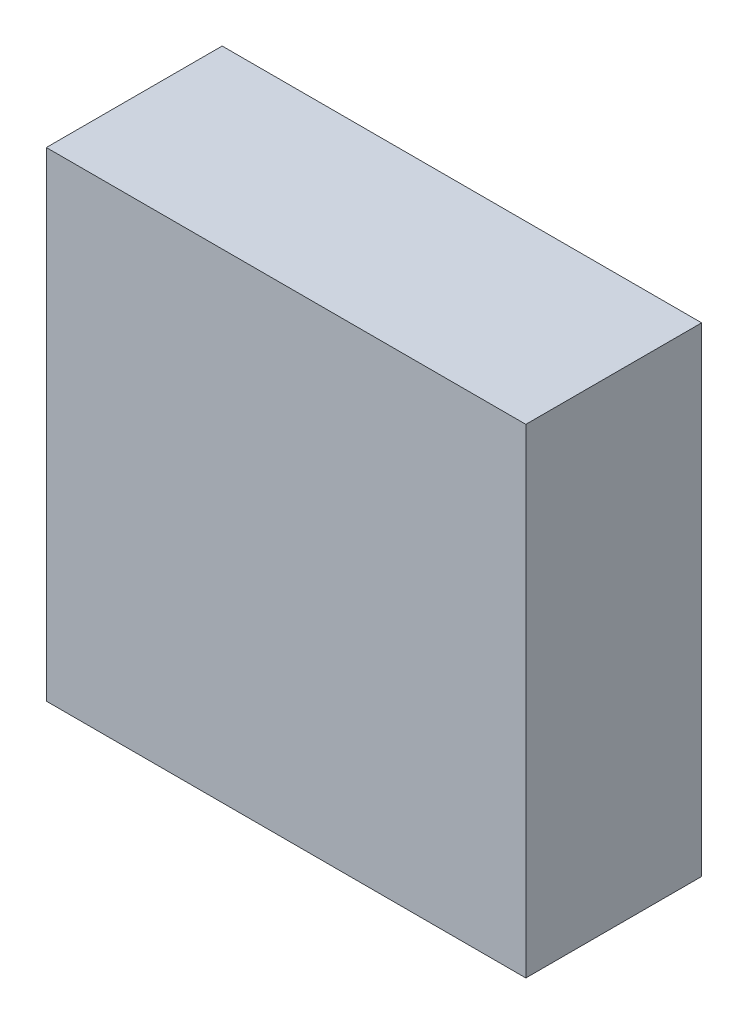
ISO-10303-21;
HEADER;
FILE_DESCRIPTION(('STEP AP214'),'2;1');
FILE_NAME('part.step','',(''),(''),'','','');
FILE_SCHEMA(('AUTOMOTIVE_DESIGN { 1 0 10303 214 1 1 1 1 }'));
ENDSEC;
DATA;
#1=APPLICATION_CONTEXT('core data for automotive mechanical design processes');
#2=APPLICATION_PROTOCOL_DEFINITION('international standard','automotive_design',2000,#1);
#3=PRODUCT_CONTEXT('',#1,'mechanical');
#4=PRODUCT('Part','Part','',(#3));
#5=PRODUCT_RELATED_PRODUCT_CATEGORY('part','',(#4));
#6=PRODUCT_DEFINITION_FORMATION('','',#4);
#7=PRODUCT_DEFINITION_CONTEXT('part definition',#1,'design');
#8=PRODUCT_DEFINITION('design','',#6,#7);
#9=PRODUCT_DEFINITION_SHAPE('','',#8);
#10=(LENGTH_UNIT() NAMED_UNIT(*) SI_UNIT(.MILLI.,.METRE.));
#11=(NAMED_UNIT(*) PLANE_ANGLE_UNIT() SI_UNIT($,.RADIAN.));
#12=(NAMED_UNIT(*) SI_UNIT($,.STERADIAN.) SOLID_ANGLE_UNIT());
#13=UNCERTAINTY_MEASURE_WITH_UNIT(LENGTH_MEASURE(1.E-05),#10,'distance_accuracy_value','');
#14=(GEOMETRIC_REPRESENTATION_CONTEXT(3) GLOBAL_UNCERTAINTY_ASSIGNED_CONTEXT((#13)) GLOBAL_UNIT_ASSIGNED_CONTEXT((#10,
#11,#12)) REPRESENTATION_CONTEXT('',''));
#15=CARTESIAN_POINT('',(0.,0.,0.));
#16=DIRECTION('',(0.,0.,1.));
#17=DIRECTION('',(1.,0.,0.));
#18=AXIS2_PLACEMENT_3D('',#15,#16,#17);
#19=CARTESIAN_POINT('',(1.49999954,1.49999954,1.10000034));
#20=DIRECTION('',(0.,0.,-1.));
#21=DIRECTION('',(-1.,0.,0.));
#22=AXIS2_PLACEMENT_3D('',#19,#20,#21);
#23=PLANE('',#22);
#24=DIRECTION('',(-8.46666930046497E-07,0.999999999999642,0.));
#25=VECTOR('',#24,1.);
#26=CARTESIAN_POINT('',(-1.49999954,1.49999954,1.10000034));
#27=LINE('',#26,#25);
#28=CARTESIAN_POINT('',(-1.49999827,1.49999954,1.10000034));
#29=VERTEX_POINT('',#28);
#30=CARTESIAN_POINT('',(-1.499997,-1.49999954,1.10000034));
#31=VERTEX_POINT('',#30);
#32=EDGE_CURVE('E55',#29,#31,#27,.F.);
#33=ORIENTED_EDGE('',*,*,#32,.T.);
#34=DIRECTION('',(1.,0.,0.));
#35=VECTOR('',#34,1.);
#36=CARTESIAN_POINT('',(-1.499997,-1.49999954,1.10000034));
#37=LINE('',#36,#35);
#38=CARTESIAN_POINT('',(1.50000081,-1.49999954,1.10000034));
#39=VERTEX_POINT('',#38);
#40=EDGE_CURVE('E57',#31,#39,#37,.T.);
#41=ORIENTED_EDGE('',*,*,#40,.T.);
#42=DIRECTION('',(8.46666925309497E-07,-0.999999999999642,0.));
#43=VECTOR('',#42,1.);
#44=CARTESIAN_POINT('',(1.50000208,-1.49999954,1.10000034));
#45=LINE('',#44,#43);
#46=CARTESIAN_POINT('',(1.49999954,1.49999954,1.10000034));
#47=VERTEX_POINT('',#46);
#48=EDGE_CURVE('E20',#39,#47,#45,.F.);
#49=ORIENTED_EDGE('',*,*,#48,.T.);
#50=DIRECTION('',(1.,0.,0.));
#51=VECTOR('',#50,1.);
#52=CARTESIAN_POINT('',(1.49999954,1.49999954,1.10000034));
#53=LINE('',#52,#51);
#54=EDGE_CURVE('E80',#47,#29,#53,.F.);
#55=ORIENTED_EDGE('',*,*,#54,.T.);
#56=EDGE_LOOP('',(#33,#41,#49,#55));
#57=FACE_BOUND('',#56,.T.);
#58=ADVANCED_FACE('F17',(#57),#23,.F.);
#59=CARTESIAN_POINT('',(1.50000208,-1.49999954,0.));
#60=DIRECTION('',(-0.999999999999642,-8.46666925309497E-07,0.));
#61=DIRECTION('',(8.46666925309497E-07,-0.999999999999642,0.));
#62=AXIS2_PLACEMENT_3D('',#59,#60,#61);
#63=PLANE('',#62);
#64=DIRECTION('',(0.,0.,-1.));
#65=VECTOR('',#64,1.);
#66=CARTESIAN_POINT('',(1.49999954,1.49999954,0.));
#67=LINE('',#66,#65);
#68=CARTESIAN_POINT('',(1.49999954,1.49999954,0.));
#69=VERTEX_POINT('',#68);
#70=EDGE_CURVE('E68',#69,#47,#67,.F.);
#71=ORIENTED_EDGE('',*,*,#70,.T.);
#72=ORIENTED_EDGE('',*,*,#48,.F.);
#73=DIRECTION('',(0.,0.,1.));
#74=VECTOR('',#73,1.);
#75=CARTESIAN_POINT('',(1.50000208,-1.49999954,0.));
#76=LINE('',#75,#74);
#77=CARTESIAN_POINT('',(1.500001445,-1.49999954,0.));
#78=VERTEX_POINT('',#77);
#79=EDGE_CURVE('E63',#39,#78,#76,.F.);
#80=ORIENTED_EDGE('',*,*,#79,.T.);
#81=DIRECTION('',(0.,1.,0.));
#82=VECTOR('',#81,1.);
#83=CARTESIAN_POINT('',(1.49999954,1.49999954,0.));
#84=LINE('',#83,#82);
#85=EDGE_CURVE('E83',#69,#78,#84,.F.);
#86=ORIENTED_EDGE('',*,*,#85,.F.);
#87=EDGE_LOOP('',(#71,#72,#80,#86));
#88=FACE_BOUND('',#87,.T.);
#89=ADVANCED_FACE('F65',(#88),#63,.F.);
#90=CARTESIAN_POINT('',(-1.499997,-1.49999954,0.));
#91=DIRECTION('',(0.,1.,0.));
#92=DIRECTION('',(0.,0.,1.));
#93=AXIS2_PLACEMENT_3D('',#90,#91,#92);
#94=PLANE('',#93);
#95=ORIENTED_EDGE('',*,*,#79,.F.);
#96=ORIENTED_EDGE('',*,*,#40,.F.);
#97=DIRECTION('',(0.,0.,1.));
#98=VECTOR('',#97,1.);
#99=CARTESIAN_POINT('',(-1.49999699999999,-1.49999954,0.));
#100=LINE('',#99,#98);
#101=CARTESIAN_POINT('',(-1.499997,-1.49999954,0.));
#102=VERTEX_POINT('',#101);
#103=EDGE_CURVE('E75',#31,#102,#100,.F.);
#104=ORIENTED_EDGE('',*,*,#103,.T.);
#105=DIRECTION('',(-1.,0.,0.));
#106=VECTOR('',#105,1.);
#107=CARTESIAN_POINT('',(1.49999954,-1.49999954,0.));
#108=LINE('',#107,#106);
#109=EDGE_CURVE('E72',#78,#102,#108,.T.);
#110=ORIENTED_EDGE('',*,*,#109,.F.);
#111=EDGE_LOOP('',(#95,#96,#104,#110));
#112=FACE_BOUND('',#111,.T.);
#113=ADVANCED_FACE('F70',(#112),#94,.F.);
#114=CARTESIAN_POINT('',(-1.49999954,1.49999954,0.));
#115=DIRECTION('',(0.999999999999642,8.46666930046497E-07,0.));
#116=DIRECTION('',(-8.46666930046497E-07,0.999999999999642,0.));
#117=AXIS2_PLACEMENT_3D('',#114,#115,#116);
#118=PLANE('',#117);
#119=ORIENTED_EDGE('',*,*,#103,.F.);
#120=ORIENTED_EDGE('',*,*,#32,.F.);
#121=DIRECTION('',(0.,0.,-1.));
#122=VECTOR('',#121,1.);
#123=CARTESIAN_POINT('',(-1.49999954,1.49999954,0.));
#124=LINE('',#123,#122);
#125=CARTESIAN_POINT('',(-1.499998905,1.49999954,0.));
#126=VERTEX_POINT('',#125);
#127=EDGE_CURVE('E35',#29,#126,#124,.T.);
#128=ORIENTED_EDGE('',*,*,#127,.T.);
#129=DIRECTION('',(0.,1.,0.));
#130=VECTOR('',#129,1.);
#131=CARTESIAN_POINT('',(-1.499997,1.49999954,0.));
#132=LINE('',#131,#130);
#133=EDGE_CURVE('E26',#102,#126,#132,.T.);
#134=ORIENTED_EDGE('',*,*,#133,.F.);
#135=EDGE_LOOP('',(#119,#120,#128,#134));
#136=FACE_BOUND('',#135,.T.);
#137=ADVANCED_FACE('F89',(#136),#118,.F.);
#138=CARTESIAN_POINT('',(1.49999954,1.49999954,0.));
#139=DIRECTION('',(0.,-1.,0.));
#140=DIRECTION('',(0.,0.,-1.));
#141=AXIS2_PLACEMENT_3D('',#138,#139,#140);
#142=PLANE('',#141);
#143=ORIENTED_EDGE('',*,*,#127,.F.);
#144=ORIENTED_EDGE('',*,*,#54,.F.);
#145=ORIENTED_EDGE('',*,*,#70,.F.);
#146=DIRECTION('',(-1.,0.,0.));
#147=VECTOR('',#146,1.);
#148=CARTESIAN_POINT('',(1.49999954,1.49999954,0.));
#149=LINE('',#148,#147);
#150=EDGE_CURVE('E11',#126,#69,#149,.F.);
#151=ORIENTED_EDGE('',*,*,#150,.F.);
#152=EDGE_LOOP('',(#143,#144,#145,#151));
#153=FACE_BOUND('',#152,.T.);
#154=ADVANCED_FACE('F91',(#153),#142,.F.);
#155=CARTESIAN_POINT('',(1.49999954,1.49999954,0.));
#156=DIRECTION('',(0.,0.,-1.));
#157=DIRECTION('',(-1.,0.,0.));
#158=AXIS2_PLACEMENT_3D('',#155,#156,#157);
#159=PLANE('',#158);
#160=ORIENTED_EDGE('',*,*,#133,.T.);
#161=ORIENTED_EDGE('',*,*,#150,.T.);
#162=ORIENTED_EDGE('',*,*,#85,.T.);
#163=ORIENTED_EDGE('',*,*,#109,.T.);
#164=EDGE_LOOP('',(#160,#161,#162,#163));
#165=FACE_BOUND('',#164,.T.);
#166=ADVANCED_FACE('F88',(#165),#159,.T.);
#167=CLOSED_SHELL('',(#58,#89,#113,#137,#154,#166));
#168=MANIFOLD_SOLID_BREP('B1',#167);
#169=ADVANCED_BREP_SHAPE_REPRESENTATION('',(#18,#168),#14);
#170=SHAPE_DEFINITION_REPRESENTATION(#9,#169);
ENDSEC;
END-ISO-10303-21;
